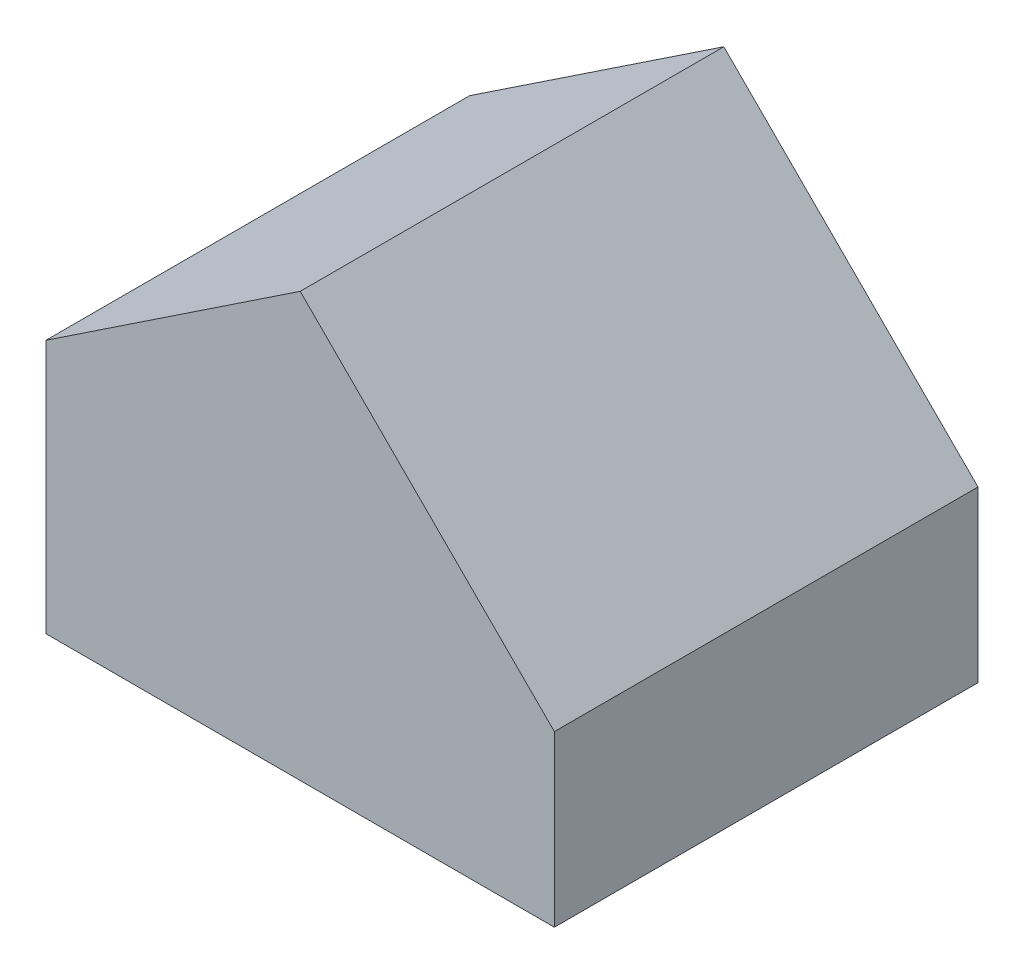
ISO-10303-21;
HEADER;
FILE_DESCRIPTION(('STEP AP214'),'2;1');
FILE_NAME('part.step','',(''),(''),'','','');
FILE_SCHEMA(('AUTOMOTIVE_DESIGN { 1 0 10303 214 1 1 1 1 }'));
ENDSEC;
DATA;
#1=APPLICATION_CONTEXT('core data for automotive mechanical design processes');
#2=APPLICATION_PROTOCOL_DEFINITION('international standard','automotive_design',2000,#1);
#3=PRODUCT_CONTEXT('',#1,'mechanical');
#4=PRODUCT('Part','Part','',(#3));
#5=PRODUCT_RELATED_PRODUCT_CATEGORY('part','',(#4));
#6=PRODUCT_DEFINITION_FORMATION('','',#4);
#7=PRODUCT_DEFINITION_CONTEXT('part definition',#1,'design');
#8=PRODUCT_DEFINITION('design','',#6,#7);
#9=PRODUCT_DEFINITION_SHAPE('','',#8);
#10=(LENGTH_UNIT() NAMED_UNIT(*) SI_UNIT(.MILLI.,.METRE.));
#11=(NAMED_UNIT(*) PLANE_ANGLE_UNIT() SI_UNIT($,.RADIAN.));
#12=(NAMED_UNIT(*) SI_UNIT($,.STERADIAN.) SOLID_ANGLE_UNIT());
#13=UNCERTAINTY_MEASURE_WITH_UNIT(LENGTH_MEASURE(1.E-05),#10,'distance_accuracy_value','');
#14=(GEOMETRIC_REPRESENTATION_CONTEXT(3) GLOBAL_UNCERTAINTY_ASSIGNED_CONTEXT((#13)) GLOBAL_UNIT_ASSIGNED_CONTEXT((#10,
#11,#12)) REPRESENTATION_CONTEXT('',''));
#15=CARTESIAN_POINT('',(0.,0.,0.));
#16=DIRECTION('',(0.,0.,1.));
#17=DIRECTION('',(1.,0.,0.));
#18=AXIS2_PLACEMENT_3D('',#15,#16,#17);
#19=CARTESIAN_POINT('',(-30.,0.,25.));
#20=DIRECTION('',(1.,0.,0.));
#21=DIRECTION('',(0.,0.,-1.));
#22=AXIS2_PLACEMENT_3D('',#19,#20,#21);
#23=PLANE('',#22);
#24=DIRECTION('',(0.,-1.,0.));
#25=VECTOR('',#24,1.);
#26=CARTESIAN_POINT('',(-30.,0.,0.));
#27=LINE('',#26,#25);
#28=CARTESIAN_POINT('',(-30.,15.,0.));
#29=VERTEX_POINT('',#28);
#30=CARTESIAN_POINT('',(-30.,0.,0.));
#31=VERTEX_POINT('',#30);
#32=EDGE_CURVE('E107',#29,#31,#27,.T.);
#33=ORIENTED_EDGE('',*,*,#32,.T.);
#34=DIRECTION('',(0.,0.,-1.));
#35=VECTOR('',#34,1.);
#36=CARTESIAN_POINT('',(-30.,0.,25.));
#37=LINE('',#36,#35);
#38=CARTESIAN_POINT('',(-30.,0.,25.));
#39=VERTEX_POINT('',#38);
#40=EDGE_CURVE('E11',#39,#31,#37,.T.);
#41=ORIENTED_EDGE('',*,*,#40,.F.);
#42=DIRECTION('',(0.,-1.,0.));
#43=VECTOR('',#42,1.);
#44=CARTESIAN_POINT('',(-30.,0.,25.));
#45=LINE('',#44,#43);
#46=CARTESIAN_POINT('',(-30.,15.,25.));
#47=VERTEX_POINT('',#46);
#48=EDGE_CURVE('E115',#47,#39,#45,.T.);
#49=ORIENTED_EDGE('',*,*,#48,.F.);
#50=DIRECTION('',(0.,0.,-1.));
#51=VECTOR('',#50,1.);
#52=CARTESIAN_POINT('',(-30.,15.,25.));
#53=LINE('',#52,#51);
#54=EDGE_CURVE('E103',#47,#29,#53,.T.);
#55=ORIENTED_EDGE('',*,*,#54,.T.);
#56=EDGE_LOOP('',(#33,#41,#49,#55));
#57=FACE_BOUND('',#56,.T.);
#58=ADVANCED_FACE('F33',(#57),#23,.F.);
#59=CARTESIAN_POINT('',(0.,0.,25.));
#60=DIRECTION('',(0.,1.,0.));
#61=DIRECTION('',(-1.,0.,0.));
#62=AXIS2_PLACEMENT_3D('',#59,#60,#61);
#63=PLANE('',#62);
#64=DIRECTION('',(1.,0.,0.));
#65=VECTOR('',#64,1.);
#66=CARTESIAN_POINT('',(0.,0.,0.));
#67=LINE('',#66,#65);
#68=CARTESIAN_POINT('',(0.,0.,0.));
#69=VERTEX_POINT('',#68);
#70=EDGE_CURVE('E110',#31,#69,#67,.T.);
#71=ORIENTED_EDGE('',*,*,#70,.T.);
#72=DIRECTION('',(0.,0.,-1.));
#73=VECTOR('',#72,1.);
#74=CARTESIAN_POINT('',(0.,0.,25.));
#75=LINE('',#74,#73);
#76=CARTESIAN_POINT('',(0.,0.,25.));
#77=VERTEX_POINT('',#76);
#78=EDGE_CURVE('E41',#77,#69,#75,.T.);
#79=ORIENTED_EDGE('',*,*,#78,.F.);
#80=DIRECTION('',(1.,0.,0.));
#81=VECTOR('',#80,1.);
#82=CARTESIAN_POINT('',(0.,0.,25.));
#83=LINE('',#82,#81);
#84=EDGE_CURVE('E83',#39,#77,#83,.T.);
#85=ORIENTED_EDGE('',*,*,#84,.F.);
#86=ORIENTED_EDGE('',*,*,#40,.T.);
#87=EDGE_LOOP('',(#71,#79,#85,#86));
#88=FACE_BOUND('',#87,.T.);
#89=ADVANCED_FACE('F134',(#88),#63,.F.);
#90=CARTESIAN_POINT('',(0.,10.,25.));
#91=DIRECTION('',(-1.,0.,0.));
#92=DIRECTION('',(0.,0.,1.));
#93=AXIS2_PLACEMENT_3D('',#90,#91,#92);
#94=PLANE('',#93);
#95=DIRECTION('',(0.,1.,0.));
#96=VECTOR('',#95,1.);
#97=CARTESIAN_POINT('',(0.,10.,0.));
#98=LINE('',#97,#96);
#99=CARTESIAN_POINT('',(0.,10.,0.));
#100=VERTEX_POINT('',#99);
#101=EDGE_CURVE('E98',#69,#100,#98,.T.);
#102=ORIENTED_EDGE('',*,*,#101,.T.);
#103=DIRECTION('',(0.,0.,-1.));
#104=VECTOR('',#103,1.);
#105=CARTESIAN_POINT('',(0.,10.,25.));
#106=LINE('',#105,#104);
#107=CARTESIAN_POINT('',(0.,10.,25.));
#108=VERTEX_POINT('',#107);
#109=EDGE_CURVE('E95',#108,#100,#106,.T.);
#110=ORIENTED_EDGE('',*,*,#109,.F.);
#111=DIRECTION('',(0.,1.,0.));
#112=VECTOR('',#111,1.);
#113=CARTESIAN_POINT('',(0.,10.,25.));
#114=LINE('',#113,#112);
#115=EDGE_CURVE('E87',#77,#108,#114,.T.);
#116=ORIENTED_EDGE('',*,*,#115,.F.);
#117=ORIENTED_EDGE('',*,*,#78,.T.);
#118=EDGE_LOOP('',(#102,#110,#116,#117));
#119=FACE_BOUND('',#118,.T.);
#120=ADVANCED_FACE('F96',(#119),#94,.F.);
#121=CARTESIAN_POINT('',(-15.,25.,25.));
#122=DIRECTION('',(-0.707106781186547,-0.707106781186548,0.));
#123=DIRECTION('',(0.707106781186548,-0.707106781186547,0.));
#124=AXIS2_PLACEMENT_3D('',#121,#122,#123);
#125=PLANE('',#124);
#126=DIRECTION('',(-0.707106781186548,0.707106781186547,0.));
#127=VECTOR('',#126,1.);
#128=CARTESIAN_POINT('',(-15.,25.,0.));
#129=LINE('',#128,#127);
#130=CARTESIAN_POINT('',(-15.,25.,0.));
#131=VERTEX_POINT('',#130);
#132=EDGE_CURVE('E69',#100,#131,#129,.T.);
#133=ORIENTED_EDGE('',*,*,#132,.T.);
#134=DIRECTION('',(0.,0.,-1.));
#135=VECTOR('',#134,1.);
#136=CARTESIAN_POINT('',(-15.,25.,25.));
#137=LINE('',#136,#135);
#138=CARTESIAN_POINT('',(-15.,25.,25.));
#139=VERTEX_POINT('',#138);
#140=EDGE_CURVE('E99',#139,#131,#137,.T.);
#141=ORIENTED_EDGE('',*,*,#140,.F.);
#142=DIRECTION('',(-0.707106781186548,0.707106781186547,0.));
#143=VECTOR('',#142,1.);
#144=CARTESIAN_POINT('',(-15.,25.,25.));
#145=LINE('',#144,#143);
#146=EDGE_CURVE('E91',#108,#139,#145,.T.);
#147=ORIENTED_EDGE('',*,*,#146,.F.);
#148=ORIENTED_EDGE('',*,*,#109,.T.);
#149=EDGE_LOOP('',(#133,#141,#147,#148));
#150=FACE_BOUND('',#149,.T.);
#151=ADVANCED_FACE('F101',(#150),#125,.F.);
#152=CARTESIAN_POINT('',(-30.,15.,25.));
#153=DIRECTION('',(0.554700196225229,-0.832050294337844,0.));
#154=DIRECTION('',(0.832050294337844,0.554700196225229,0.));
#155=AXIS2_PLACEMENT_3D('',#152,#153,#154);
#156=PLANE('',#155);
#157=DIRECTION('',(-0.832050294337844,-0.554700196225229,0.));
#158=VECTOR('',#157,1.);
#159=CARTESIAN_POINT('',(-30.,15.,0.));
#160=LINE('',#159,#158);
#161=EDGE_CURVE('E75',#131,#29,#160,.T.);
#162=ORIENTED_EDGE('',*,*,#161,.T.);
#163=ORIENTED_EDGE('',*,*,#54,.F.);
#164=DIRECTION('',(-0.832050294337844,-0.554700196225229,0.));
#165=VECTOR('',#164,1.);
#166=CARTESIAN_POINT('',(-30.,15.,25.));
#167=LINE('',#166,#165);
#168=EDGE_CURVE('E49',#139,#47,#167,.T.);
#169=ORIENTED_EDGE('',*,*,#168,.F.);
#170=ORIENTED_EDGE('',*,*,#140,.T.);
#171=EDGE_LOOP('',(#162,#163,#169,#170));
#172=FACE_BOUND('',#171,.T.);
#173=ADVANCED_FACE('F123',(#172),#156,.F.);
#174=CARTESIAN_POINT('',(0.,0.,25.));
#175=DIRECTION('',(0.,0.,1.));
#176=DIRECTION('',(1.,0.,0.));
#177=AXIS2_PLACEMENT_3D('',#174,#175,#176);
#178=PLANE('',#177);
#179=ORIENTED_EDGE('',*,*,#48,.T.);
#180=ORIENTED_EDGE('',*,*,#84,.T.);
#181=ORIENTED_EDGE('',*,*,#115,.T.);
#182=ORIENTED_EDGE('',*,*,#146,.T.);
#183=ORIENTED_EDGE('',*,*,#168,.T.);
#184=EDGE_LOOP('',(#179,#180,#181,#182,#183));
#185=FACE_BOUND('',#184,.T.);
#186=ADVANCED_FACE('F89',(#185),#178,.T.);
#187=CARTESIAN_POINT('',(0.,0.,0.));
#188=DIRECTION('',(0.,0.,1.));
#189=DIRECTION('',(1.,0.,0.));
#190=AXIS2_PLACEMENT_3D('',#187,#188,#189);
#191=PLANE('',#190);
#192=ORIENTED_EDGE('',*,*,#32,.F.);
#193=ORIENTED_EDGE('',*,*,#161,.F.);
#194=ORIENTED_EDGE('',*,*,#132,.F.);
#195=ORIENTED_EDGE('',*,*,#101,.F.);
#196=ORIENTED_EDGE('',*,*,#70,.F.);
#197=EDGE_LOOP('',(#192,#193,#194,#195,#196));
#198=FACE_BOUND('',#197,.T.);
#199=ADVANCED_FACE('F119',(#198),#191,.F.);
#200=CLOSED_SHELL('',(#58,#89,#120,#151,#173,#186,#199));
#201=MANIFOLD_SOLID_BREP('B2',#200);
#202=ADVANCED_BREP_SHAPE_REPRESENTATION('',(#18,#201),#14);
#203=SHAPE_DEFINITION_REPRESENTATION(#9,#202);
ENDSEC;
END-ISO-10303-21;
